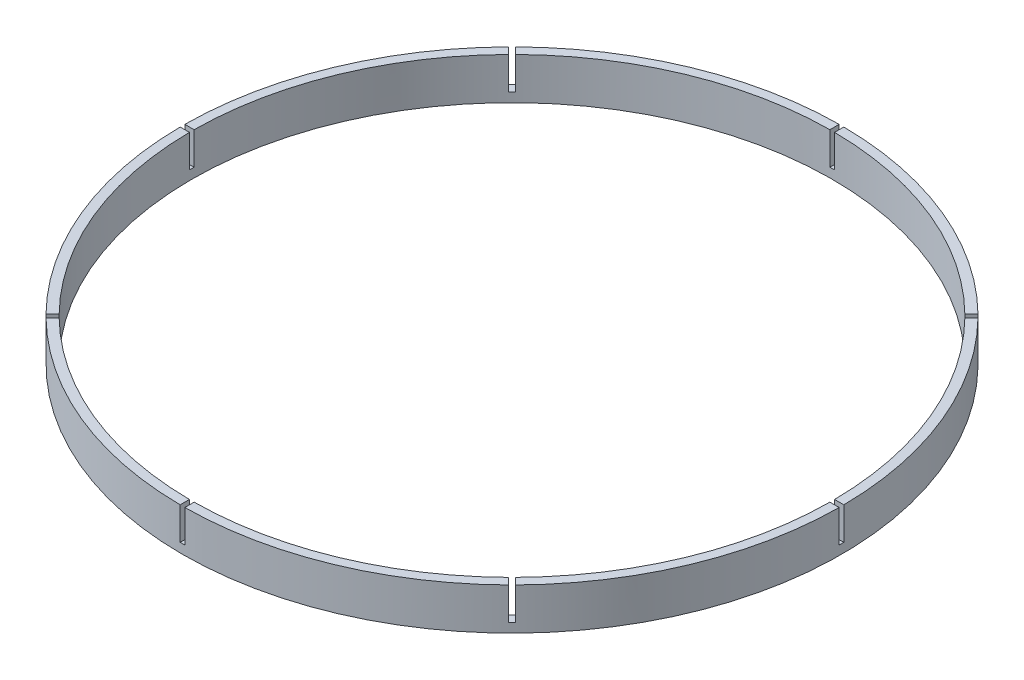
ISO-10303-21;
HEADER;
FILE_DESCRIPTION(('STEP AP214'),'2;1');
FILE_NAME('part.step','',(''),(''),'','','');
FILE_SCHEMA(('AUTOMOTIVE_DESIGN { 1 0 10303 214 1 1 1 1 }'));
ENDSEC;
DATA;
#1=APPLICATION_CONTEXT('core data for automotive mechanical design processes');
#2=APPLICATION_PROTOCOL_DEFINITION('international standard','automotive_design',2000,#1);
#3=PRODUCT_CONTEXT('',#1,'mechanical');
#4=PRODUCT('Part','Part','',(#3));
#5=PRODUCT_RELATED_PRODUCT_CATEGORY('part','',(#4));
#6=PRODUCT_DEFINITION_FORMATION('','',#4);
#7=PRODUCT_DEFINITION_CONTEXT('part definition',#1,'design');
#8=PRODUCT_DEFINITION('design','',#6,#7);
#9=PRODUCT_DEFINITION_SHAPE('','',#8);
#10=(LENGTH_UNIT() NAMED_UNIT(*) SI_UNIT(.MILLI.,.METRE.));
#11=(NAMED_UNIT(*) PLANE_ANGLE_UNIT() SI_UNIT($,.RADIAN.));
#12=(NAMED_UNIT(*) SI_UNIT($,.STERADIAN.) SOLID_ANGLE_UNIT());
#13=UNCERTAINTY_MEASURE_WITH_UNIT(LENGTH_MEASURE(1.E-05),#10,'distance_accuracy_value','');
#14=(GEOMETRIC_REPRESENTATION_CONTEXT(3) GLOBAL_UNCERTAINTY_ASSIGNED_CONTEXT((#13)) GLOBAL_UNIT_ASSIGNED_CONTEXT((#10,
#11,#12)) REPRESENTATION_CONTEXT('',''));
#15=CARTESIAN_POINT('',(0.,0.,0.));
#16=DIRECTION('',(0.,0.,1.));
#17=DIRECTION('',(1.,0.,0.));
#18=AXIS2_PLACEMENT_3D('',#15,#16,#17);
#19=CARTESIAN_POINT('',(0.,9.,0.));
#20=DIRECTION('',(0.,1.,0.));
#21=DIRECTION('',(0.,0.,1.));
#22=AXIS2_PLACEMENT_3D('',#19,#20,#21);
#23=PLANE('',#22);
#24=DIRECTION('',(1.,0.,0.));
#25=VECTOR('',#24,1.);
#26=CARTESIAN_POINT('',(-68.9981883820148,9.,0.500000000000241));
#27=LINE('',#26,#25);
#28=CARTESIAN_POINT('',(-70.9982394147911,9.,0.500000000000242));
#29=VERTEX_POINT('',#28);
#30=CARTESIAN_POINT('',(-68.9981883820148,9.,0.500000000000241));
#31=VERTEX_POINT('',#30);
#32=EDGE_CURVE('E500',#29,#31,#27,.T.);
#33=ORIENTED_EDGE('',*,*,#32,.F.);
#34=CARTESIAN_POINT('',(0.,9.,0.));
#35=DIRECTION('',(0.,1.,0.));
#36=DIRECTION('',(0.,0.,1.));
#37=AXIS2_PLACEMENT_3D('',#34,#35,#36);
#38=CIRCLE('',#37,71.);
#39=CARTESIAN_POINT('',(-50.5568899330978,9.,49.8497831519118));
#40=VERTEX_POINT('',#39);
#41=EDGE_CURVE('E653',#29,#40,#38,.T.);
#42=ORIENTED_EDGE('',*,*,#41,.T.);
#43=DIRECTION('',(-0.707106781186544,0.,0.707106781186551));
#44=VECTOR('',#43,1.);
#45=CARTESIAN_POINT('',(-49.1426402851025,9.,48.4355335039165));
#46=LINE('',#45,#44);
#47=CARTESIAN_POINT('',(-49.1426402851025,9.,48.4355335039165));
#48=VERTEX_POINT('',#47);
#49=EDGE_CURVE('E521',#48,#40,#46,.T.);
#50=ORIENTED_EDGE('',*,*,#49,.F.);
#51=CARTESIAN_POINT('',(0.,9.,0.));
#52=DIRECTION('',(0.,1.,0.));
#53=DIRECTION('',(0.,0.,1.));
#54=AXIS2_PLACEMENT_3D('',#51,#52,#53);
#55=CIRCLE('',#54,69.);
#56=EDGE_CURVE('E622',#31,#48,#55,.T.);
#57=ORIENTED_EDGE('',*,*,#56,.F.);
#58=EDGE_LOOP('',(#33,#42,#50,#57));
#59=FACE_BOUND('',#58,.T.);
#60=ADVANCED_FACE('F35',(#59),#23,.T.);
#61=DIRECTION('',(0.707106781186544,0.,-0.707106781186551));
#62=VECTOR('',#61,1.);
#63=CARTESIAN_POINT('',(-48.435533503916,9.,49.142640285103));
#64=LINE('',#63,#62);
#65=CARTESIAN_POINT('',(-49.8497831519113,9.,50.5568899330984));
#66=VERTEX_POINT('',#65);
#67=CARTESIAN_POINT('',(-48.435533503916,9.,49.142640285103));
#68=VERTEX_POINT('',#67);
#69=EDGE_CURVE('E523',#66,#68,#64,.T.);
#70=ORIENTED_EDGE('',*,*,#69,.F.);
#71=CARTESIAN_POINT('',(-0.5,9.,70.9982394147911));
#72=VERTEX_POINT('',#71);
#73=EDGE_CURVE('E633',#66,#72,#38,.T.);
#74=ORIENTED_EDGE('',*,*,#73,.T.);
#75=DIRECTION('',(0.,0.,1.));
#76=VECTOR('',#75,1.);
#77=CARTESIAN_POINT('',(-0.5,9.,68.9981883820148));
#78=LINE('',#77,#76);
#79=CARTESIAN_POINT('',(-0.5,9.,68.9981883820148));
#80=VERTEX_POINT('',#79);
#81=EDGE_CURVE('E544',#80,#72,#78,.T.);
#82=ORIENTED_EDGE('',*,*,#81,.F.);
#83=EDGE_CURVE('E278',#68,#80,#55,.T.);
#84=ORIENTED_EDGE('',*,*,#83,.F.);
#85=EDGE_LOOP('',(#70,#74,#82,#84));
#86=FACE_BOUND('',#85,.T.);
#87=ADVANCED_FACE('F346',(#86),#23,.T.);
#88=DIRECTION('',(0.,0.,-1.));
#89=VECTOR('',#88,1.);
#90=CARTESIAN_POINT('',(0.5,9.,68.9981883820148));
#91=LINE('',#90,#89);
#92=CARTESIAN_POINT('',(0.499999999999994,9.,70.9982394147911));
#93=VERTEX_POINT('',#92);
#94=CARTESIAN_POINT('',(0.5,9.,68.9981883820148));
#95=VERTEX_POINT('',#94);
#96=EDGE_CURVE('E546',#93,#95,#91,.T.);
#97=ORIENTED_EDGE('',*,*,#96,.F.);
#98=CARTESIAN_POINT('',(49.849783151912,9.,50.5568899330977));
#99=VERTEX_POINT('',#98);
#100=EDGE_CURVE('E647',#93,#99,#38,.T.);
#101=ORIENTED_EDGE('',*,*,#100,.T.);
#102=DIRECTION('',(0.707106781186554,0.,0.707106781186541));
#103=VECTOR('',#102,1.);
#104=CARTESIAN_POINT('',(48.4355335039167,9.,49.1426402851024));
#105=LINE('',#104,#103);
#106=CARTESIAN_POINT('',(48.4355335039167,9.,49.1426402851024));
#107=VERTEX_POINT('',#106);
#108=EDGE_CURVE('E455',#107,#99,#105,.T.);
#109=ORIENTED_EDGE('',*,*,#108,.F.);
#110=EDGE_CURVE('E274',#95,#107,#55,.T.);
#111=ORIENTED_EDGE('',*,*,#110,.F.);
#112=EDGE_LOOP('',(#97,#101,#109,#111));
#113=FACE_BOUND('',#112,.T.);
#114=ADVANCED_FACE('F351',(#113),#23,.T.);
#115=DIRECTION('',(-0.707106781186554,0.,-0.707106781186541));
#116=VECTOR('',#115,1.);
#117=CARTESIAN_POINT('',(49.1426402851032,9.,48.4355335039158));
#118=LINE('',#117,#116);
#119=CARTESIAN_POINT('',(50.5568899330985,9.,49.8497831519111));
#120=VERTEX_POINT('',#119);
#121=CARTESIAN_POINT('',(49.1426402851032,9.,48.4355335039158));
#122=VERTEX_POINT('',#121);
#123=EDGE_CURVE('E567',#120,#122,#118,.T.);
#124=ORIENTED_EDGE('',*,*,#123,.F.);
#125=CARTESIAN_POINT('',(70.9982394147911,9.,0.499999999999256));
#126=VERTEX_POINT('',#125);
#127=EDGE_CURVE('E266',#120,#126,#38,.T.);
#128=ORIENTED_EDGE('',*,*,#127,.T.);
#129=DIRECTION('',(1.,0.,0.));
#130=VECTOR('',#129,1.);
#131=CARTESIAN_POINT('',(68.9981883820148,9.,0.499999999999277));
#132=LINE('',#131,#130);
#133=CARTESIAN_POINT('',(68.9981883820148,9.,0.499999999999277));
#134=VERTEX_POINT('',#133);
#135=EDGE_CURVE('E248',#134,#126,#132,.T.);
#136=ORIENTED_EDGE('',*,*,#135,.F.);
#137=EDGE_CURVE('E264',#122,#134,#55,.T.);
#138=ORIENTED_EDGE('',*,*,#137,.F.);
#139=EDGE_LOOP('',(#124,#128,#136,#138));
#140=FACE_BOUND('',#139,.T.);
#141=ADVANCED_FACE('F263',(#140),#23,.T.);
#142=DIRECTION('',(-1.,0.,0.));
#143=VECTOR('',#142,1.);
#144=CARTESIAN_POINT('',(68.9981883820148,9.,-0.500000000000723));
#145=LINE('',#144,#143);
#146=CARTESIAN_POINT('',(70.9982394147911,9.,-0.500000000000738));
#147=VERTEX_POINT('',#146);
#148=CARTESIAN_POINT('',(68.9981883820148,9.,-0.500000000000723));
#149=VERTEX_POINT('',#148);
#150=EDGE_CURVE('E257',#147,#149,#145,.T.);
#151=ORIENTED_EDGE('',*,*,#150,.F.);
#152=CARTESIAN_POINT('',(50.5568899330975,9.,-49.8497831519122));
#153=VERTEX_POINT('',#152);
#154=EDGE_CURVE('E329',#147,#153,#38,.T.);
#155=ORIENTED_EDGE('',*,*,#154,.T.);
#156=DIRECTION('',(0.707106781186539,0.,-0.707106781186556));
#157=VECTOR('',#156,1.);
#158=CARTESIAN_POINT('',(49.1426402851022,9.,-48.4355335039168));
#159=LINE('',#158,#157);
#160=CARTESIAN_POINT('',(49.1426402851022,9.,-48.4355335039168));
#161=VERTEX_POINT('',#160);
#162=EDGE_CURVE('E476',#161,#153,#159,.T.);
#163=ORIENTED_EDGE('',*,*,#162,.F.);
#164=EDGE_CURVE('E275',#149,#161,#55,.T.);
#165=ORIENTED_EDGE('',*,*,#164,.F.);
#166=EDGE_LOOP('',(#151,#155,#163,#165));
#167=FACE_BOUND('',#166,.T.);
#168=ADVANCED_FACE('F668',(#167),#23,.T.);
#169=DIRECTION('',(-0.707106781186539,0.,0.707106781186556));
#170=VECTOR('',#169,1.);
#171=CARTESIAN_POINT('',(48.4355335039156,9.,-49.1426402851034));
#172=LINE('',#171,#170);
#173=CARTESIAN_POINT('',(49.849783151911,9.,-50.5568899330987));
#174=VERTEX_POINT('',#173);
#175=CARTESIAN_POINT('',(48.4355335039156,9.,-49.1426402851034));
#176=VERTEX_POINT('',#175);
#177=EDGE_CURVE('E326',#174,#176,#172,.T.);
#178=ORIENTED_EDGE('',*,*,#177,.F.);
#179=CARTESIAN_POINT('',(0.5,9.,-70.9982394147911));
#180=VERTEX_POINT('',#179);
#181=EDGE_CURVE('E45',#174,#180,#38,.T.);
#182=ORIENTED_EDGE('',*,*,#181,.T.);
#183=DIRECTION('',(0.,0.,-1.));
#184=VECTOR('',#183,1.);
#185=CARTESIAN_POINT('',(0.5,9.,-68.9981883820148));
#186=LINE('',#185,#184);
#187=CARTESIAN_POINT('',(0.5,9.,-68.9981883820148));
#188=VERTEX_POINT('',#187);
#189=EDGE_CURVE('E306',#188,#180,#186,.T.);
#190=ORIENTED_EDGE('',*,*,#189,.F.);
#191=EDGE_CURVE('E280',#176,#188,#55,.T.);
#192=ORIENTED_EDGE('',*,*,#191,.F.);
#193=EDGE_LOOP('',(#178,#182,#190,#192));
#194=FACE_BOUND('',#193,.T.);
#195=ADVANCED_FACE('F324',(#194),#23,.T.);
#196=DIRECTION('',(-1.,0.,0.));
#197=VECTOR('',#196,1.);
#198=CARTESIAN_POINT('',(-68.9981883820148,9.,-0.499999999999759));
#199=LINE('',#198,#197);
#200=CARTESIAN_POINT('',(-68.9981883820148,9.,-0.499999999999759));
#201=VERTEX_POINT('',#200);
#202=CARTESIAN_POINT('',(-70.9982394147911,9.,-0.499999999999752));
#203=VERTEX_POINT('',#202);
#204=EDGE_CURVE('E498',#201,#203,#199,.T.);
#205=ORIENTED_EDGE('',*,*,#204,.F.);
#206=CARTESIAN_POINT('',(-49.1426402851029,9.,-48.4355335039161));
#207=VERTEX_POINT('',#206);
#208=EDGE_CURVE('E285',#207,#201,#55,.T.);
#209=ORIENTED_EDGE('',*,*,#208,.F.);
#210=DIRECTION('',(0.707106781186549,0.,0.707106781186546));
#211=VECTOR('',#210,1.);
#212=CARTESIAN_POINT('',(-49.1426402851029,9.,-48.4355335039161));
#213=LINE('',#212,#211);
#214=CARTESIAN_POINT('',(-50.5568899330982,9.,-49.8497831519115));
#215=VERTEX_POINT('',#214);
#216=EDGE_CURVE('E588',#215,#207,#213,.T.);
#217=ORIENTED_EDGE('',*,*,#216,.F.);
#218=EDGE_CURVE('E44',#215,#203,#38,.T.);
#219=ORIENTED_EDGE('',*,*,#218,.T.);
#220=EDGE_LOOP('',(#205,#209,#217,#219));
#221=FACE_BOUND('',#220,.T.);
#222=ADVANCED_FACE('F342',(#221),#23,.T.);
#223=DIRECTION('',(-0.707106781186549,0.,-0.707106781186546));
#224=VECTOR('',#223,1.);
#225=CARTESIAN_POINT('',(-48.4355335039163,9.,-49.1426402851027));
#226=LINE('',#225,#224);
#227=CARTESIAN_POINT('',(-48.4355335039163,9.,-49.1426402851027));
#228=VERTEX_POINT('',#227);
#229=CARTESIAN_POINT('',(-49.8497831519117,9.,-50.556889933098));
#230=VERTEX_POINT('',#229);
#231=EDGE_CURVE('E512',#228,#230,#226,.T.);
#232=ORIENTED_EDGE('',*,*,#231,.F.);
#233=CARTESIAN_POINT('',(-0.5,9.,-68.9981883820148));
#234=VERTEX_POINT('',#233);
#235=EDGE_CURVE('E281',#234,#228,#55,.T.);
#236=ORIENTED_EDGE('',*,*,#235,.F.);
#237=DIRECTION('',(0.,0.,1.));
#238=VECTOR('',#237,1.);
#239=CARTESIAN_POINT('',(-0.5,9.,-68.9981883820148));
#240=LINE('',#239,#238);
#241=CARTESIAN_POINT('',(-0.499999999999994,9.,-70.9982394147911));
#242=VERTEX_POINT('',#241);
#243=EDGE_CURVE('E309',#242,#234,#240,.T.);
#244=ORIENTED_EDGE('',*,*,#243,.F.);
#245=EDGE_CURVE('E12',#242,#230,#38,.T.);
#246=ORIENTED_EDGE('',*,*,#245,.T.);
#247=EDGE_LOOP('',(#232,#236,#244,#246));
#248=FACE_BOUND('',#247,.T.);
#249=ADVANCED_FACE('F337',(#248),#23,.T.);
#250=CARTESIAN_POINT('',(0.,0.,0.));
#251=DIRECTION('',(0.,1.,0.));
#252=DIRECTION('',(0.,0.,1.));
#253=AXIS2_PLACEMENT_3D('',#250,#251,#252);
#254=PLANE('',#253);
#255=CARTESIAN_POINT('',(0.,0.,0.));
#256=DIRECTION('',(0.,1.,0.));
#257=DIRECTION('',(0.,0.,1.));
#258=AXIS2_PLACEMENT_3D('',#255,#256,#257);
#259=CIRCLE('',#258,71.);
#260=CARTESIAN_POINT('',(0.,0.,71.));
#261=VERTEX_POINT('',#260);
#262=EDGE_CURVE('E39',#261,#261,#259,.T.);
#263=ORIENTED_EDGE('',*,*,#262,.F.);
#264=EDGE_LOOP('',(#263));
#265=FACE_BOUND('',#264,.T.);
#266=CARTESIAN_POINT('',(0.,0.,0.));
#267=DIRECTION('',(0.,1.,0.));
#268=DIRECTION('',(0.,0.,1.));
#269=AXIS2_PLACEMENT_3D('',#266,#267,#268);
#270=CIRCLE('',#269,69.);
#271=CARTESIAN_POINT('',(0.,0.,69.));
#272=VERTEX_POINT('',#271);
#273=EDGE_CURVE('E288',#272,#272,#270,.T.);
#274=ORIENTED_EDGE('',*,*,#273,.T.);
#275=EDGE_LOOP('',(#274));
#276=FACE_BOUND('',#275,.T.);
#277=ADVANCED_FACE('F335',(#265,#276),#254,.F.);
#278=CARTESIAN_POINT('',(0.,9.,0.));
#279=DIRECTION('',(0.,-1.,0.));
#280=DIRECTION('',(0.,0.,-1.));
#281=AXIS2_PLACEMENT_3D('',#278,#279,#280);
#282=CYLINDRICAL_SURFACE('',#281,71.);
#283=ORIENTED_EDGE('',*,*,#41,.F.);
#284=DIRECTION('',(0.,1.,0.));
#285=VECTOR('',#284,1.);
#286=CARTESIAN_POINT('',(-70.9982394147911,-2.23768848455292,0.500000000000242));
#287=LINE('',#286,#285);
#288=CARTESIAN_POINT('',(-70.9982394147911,2.,0.500000000000242));
#289=VERTEX_POINT('',#288);
#290=EDGE_CURVE('E505',#289,#29,#287,.T.);
#291=ORIENTED_EDGE('',*,*,#290,.F.);
#292=CARTESIAN_POINT('',(0.,2.,0.));
#293=DIRECTION('',(0.,1.,0.));
#294=DIRECTION('',(0.,0.,1.));
#295=AXIS2_PLACEMENT_3D('',#292,#293,#294);
#296=CIRCLE('',#295,71.);
#297=CARTESIAN_POINT('',(-70.9982394147911,2.,-0.499999999999752));
#298=VERTEX_POINT('',#297);
#299=EDGE_CURVE('E489',#289,#298,#296,.F.);
#300=ORIENTED_EDGE('',*,*,#299,.T.);
#301=DIRECTION('',(0.,1.,0.));
#302=VECTOR('',#301,1.);
#303=CARTESIAN_POINT('',(-70.9982394147911,-2.23768848455292,-0.499999999999752));
#304=LINE('',#303,#302);
#305=EDGE_CURVE('E507',#298,#203,#304,.T.);
#306=ORIENTED_EDGE('',*,*,#305,.T.);
#307=ORIENTED_EDGE('',*,*,#218,.F.);
#308=DIRECTION('',(0.,1.,0.));
#309=VECTOR('',#308,1.);
#310=CARTESIAN_POINT('',(-50.5568899330982,-3.00005103277637,-49.8497831519115));
#311=LINE('',#310,#309);
#312=CARTESIAN_POINT('',(-50.5568899330982,2.,-49.8497831519115));
#313=VERTEX_POINT('',#312);
#314=EDGE_CURVE('E593',#313,#215,#311,.T.);
#315=ORIENTED_EDGE('',*,*,#314,.F.);
#316=CARTESIAN_POINT('',(0.,2.,0.));
#317=DIRECTION('',(0.,1.,0.));
#318=DIRECTION('',(0.,0.,1.));
#319=AXIS2_PLACEMENT_3D('',#316,#317,#318);
#320=CIRCLE('',#319,71.);
#321=CARTESIAN_POINT('',(-49.8497831519117,2.,-50.556889933098));
#322=VERTEX_POINT('',#321);
#323=EDGE_CURVE('E578',#313,#322,#320,.F.);
#324=ORIENTED_EDGE('',*,*,#323,.T.);
#325=DIRECTION('',(0.,1.,0.));
#326=VECTOR('',#325,1.);
#327=CARTESIAN_POINT('',(-49.8497831519117,-3.00005103277637,-50.556889933098));
#328=LINE('',#327,#326);
#329=EDGE_CURVE('E595',#322,#230,#328,.T.);
#330=ORIENTED_EDGE('',*,*,#329,.T.);
#331=ORIENTED_EDGE('',*,*,#245,.F.);
#332=DIRECTION('',(0.,1.,0.));
#333=VECTOR('',#332,1.);
#334=CARTESIAN_POINT('',(-0.499999999999994,-2.23768848455292,-70.9982394147911));
#335=LINE('',#334,#333);
#336=CARTESIAN_POINT('',(-0.499999999999994,2.,-70.9982394147911));
#337=VERTEX_POINT('',#336);
#338=EDGE_CURVE('E315',#337,#242,#335,.T.);
#339=ORIENTED_EDGE('',*,*,#338,.F.);
#340=CARTESIAN_POINT('',(0.,2.,0.));
#341=DIRECTION('',(0.,1.,0.));
#342=DIRECTION('',(0.,0.,1.));
#343=AXIS2_PLACEMENT_3D('',#340,#341,#342);
#344=CIRCLE('',#343,71.);
#345=CARTESIAN_POINT('',(0.5,2.,-70.9982394147911));
#346=VERTEX_POINT('',#345);
#347=EDGE_CURVE('E302',#337,#346,#344,.F.);
#348=ORIENTED_EDGE('',*,*,#347,.T.);
#349=DIRECTION('',(0.,1.,0.));
#350=VECTOR('',#349,1.);
#351=CARTESIAN_POINT('',(0.5,-2.23768848455292,-70.9982394147911));
#352=LINE('',#351,#350);
#353=EDGE_CURVE('E317',#346,#180,#352,.T.);
#354=ORIENTED_EDGE('',*,*,#353,.T.);
#355=ORIENTED_EDGE('',*,*,#181,.F.);
#356=DIRECTION('',(0.,1.,0.));
#357=VECTOR('',#356,1.);
#358=CARTESIAN_POINT('',(49.849783151911,-3.00005103277639,-50.5568899330987));
#359=LINE('',#358,#357);
#360=CARTESIAN_POINT('',(49.849783151911,2.,-50.5568899330987));
#361=VERTEX_POINT('',#360);
#362=EDGE_CURVE('E482',#361,#174,#359,.T.);
#363=ORIENTED_EDGE('',*,*,#362,.F.);
#364=CARTESIAN_POINT('',(0.,2.,0.));
#365=DIRECTION('',(0.,1.,0.));
#366=DIRECTION('',(0.,0.,1.));
#367=AXIS2_PLACEMENT_3D('',#364,#365,#366);
#368=CIRCLE('',#367,71.);
#369=CARTESIAN_POINT('',(50.5568899330975,2.,-49.8497831519122));
#370=VERTEX_POINT('',#369);
#371=EDGE_CURVE('E467',#361,#370,#368,.F.);
#372=ORIENTED_EDGE('',*,*,#371,.T.);
#373=DIRECTION('',(0.,1.,0.));
#374=VECTOR('',#373,1.);
#375=CARTESIAN_POINT('',(50.5568899330975,-3.00005103277639,-49.8497831519122));
#376=LINE('',#375,#374);
#377=EDGE_CURVE('E484',#370,#153,#376,.T.);
#378=ORIENTED_EDGE('',*,*,#377,.T.);
#379=ORIENTED_EDGE('',*,*,#154,.F.);
#380=DIRECTION('',(0.,1.,0.));
#381=VECTOR('',#380,1.);
#382=CARTESIAN_POINT('',(70.9982394147911,-2.23768848455292,-0.500000000000738));
#383=LINE('',#382,#381);
#384=CARTESIAN_POINT('',(70.9982394147911,2.,-0.500000000000737));
#385=VERTEX_POINT('',#384);
#386=EDGE_CURVE('E464',#385,#147,#383,.T.);
#387=ORIENTED_EDGE('',*,*,#386,.F.);
#388=CARTESIAN_POINT('',(0.,2.,0.));
#389=DIRECTION('',(0.,1.,0.));
#390=DIRECTION('',(0.,0.,1.));
#391=AXIS2_PLACEMENT_3D('',#388,#389,#390);
#392=CIRCLE('',#391,71.);
#393=CARTESIAN_POINT('',(70.9982394147911,2.,0.499999999999256));
#394=VERTEX_POINT('',#393);
#395=EDGE_CURVE('E457',#385,#394,#392,.F.);
#396=ORIENTED_EDGE('',*,*,#395,.T.);
#397=DIRECTION('',(0.,1.,0.));
#398=VECTOR('',#397,1.);
#399=CARTESIAN_POINT('',(70.9982394147911,-2.23768848455292,0.499999999999256));
#400=LINE('',#399,#398);
#401=EDGE_CURVE('E256',#394,#126,#400,.T.);
#402=ORIENTED_EDGE('',*,*,#401,.T.);
#403=ORIENTED_EDGE('',*,*,#127,.F.);
#404=DIRECTION('',(0.,1.,0.));
#405=VECTOR('',#404,1.);
#406=CARTESIAN_POINT('',(50.5568899330985,-3.00005103277638,49.8497831519111));
#407=LINE('',#406,#405);
#408=CARTESIAN_POINT('',(50.5568899330985,2.,49.8497831519111));
#409=VERTEX_POINT('',#408);
#410=EDGE_CURVE('E571',#409,#120,#407,.T.);
#411=ORIENTED_EDGE('',*,*,#410,.F.);
#412=CARTESIAN_POINT('',(0.,2.,0.));
#413=DIRECTION('',(0.,1.,0.));
#414=DIRECTION('',(0.,0.,1.));
#415=AXIS2_PLACEMENT_3D('',#412,#413,#414);
#416=CIRCLE('',#415,71.);
#417=CARTESIAN_POINT('',(49.849783151912,2.,50.5568899330977));
#418=VERTEX_POINT('',#417);
#419=EDGE_CURVE('E559',#409,#418,#416,.F.);
#420=ORIENTED_EDGE('',*,*,#419,.T.);
#421=DIRECTION('',(0.,1.,0.));
#422=VECTOR('',#421,1.);
#423=CARTESIAN_POINT('',(49.849783151912,-3.00005103277638,50.5568899330977));
#424=LINE('',#423,#422);
#425=EDGE_CURVE('E573',#418,#99,#424,.T.);
#426=ORIENTED_EDGE('',*,*,#425,.T.);
#427=ORIENTED_EDGE('',*,*,#100,.F.);
#428=DIRECTION('',(0.,1.,0.));
#429=VECTOR('',#428,1.);
#430=CARTESIAN_POINT('',(0.499999999999994,-2.23768848455292,70.9982394147911));
#431=LINE('',#430,#429);
#432=CARTESIAN_POINT('',(0.499999999999994,2.,70.9982394147911));
#433=VERTEX_POINT('',#432);
#434=EDGE_CURVE('E552',#433,#93,#431,.T.);
#435=ORIENTED_EDGE('',*,*,#434,.F.);
#436=CARTESIAN_POINT('',(0.,2.,0.));
#437=DIRECTION('',(0.,1.,0.));
#438=DIRECTION('',(0.,0.,1.));
#439=AXIS2_PLACEMENT_3D('',#436,#437,#438);
#440=CIRCLE('',#439,71.);
#441=CARTESIAN_POINT('',(-0.5,2.,70.9982394147911));
#442=VERTEX_POINT('',#441);
#443=EDGE_CURVE('E535',#433,#442,#440,.F.);
#444=ORIENTED_EDGE('',*,*,#443,.T.);
#445=DIRECTION('',(0.,1.,0.));
#446=VECTOR('',#445,1.);
#447=CARTESIAN_POINT('',(-0.5,-2.23768848455292,70.9982394147911));
#448=LINE('',#447,#446);
#449=EDGE_CURVE('E554',#442,#72,#448,.T.);
#450=ORIENTED_EDGE('',*,*,#449,.T.);
#451=ORIENTED_EDGE('',*,*,#73,.F.);
#452=DIRECTION('',(0.,1.,0.));
#453=VECTOR('',#452,1.);
#454=CARTESIAN_POINT('',(-49.8497831519113,-3.00005103277637,50.5568899330984));
#455=LINE('',#454,#453);
#456=CARTESIAN_POINT('',(-49.8497831519113,2.,50.5568899330984));
#457=VERTEX_POINT('',#456);
#458=EDGE_CURVE('E528',#457,#66,#455,.T.);
#459=ORIENTED_EDGE('',*,*,#458,.F.);
#460=CARTESIAN_POINT('',(0.,2.,0.));
#461=DIRECTION('',(0.,1.,0.));
#462=DIRECTION('',(0.,0.,1.));
#463=AXIS2_PLACEMENT_3D('',#460,#461,#462);
#464=CIRCLE('',#463,71.);
#465=CARTESIAN_POINT('',(-50.5568899330978,2.,49.8497831519118));
#466=VERTEX_POINT('',#465);
#467=EDGE_CURVE('E513',#457,#466,#464,.F.);
#468=ORIENTED_EDGE('',*,*,#467,.T.);
#469=DIRECTION('',(0.,1.,0.));
#470=VECTOR('',#469,1.);
#471=CARTESIAN_POINT('',(-50.5568899330978,-3.00005103277637,49.8497831519118));
#472=LINE('',#471,#470);
#473=EDGE_CURVE('E530',#466,#40,#472,.T.);
#474=ORIENTED_EDGE('',*,*,#473,.T.);
#475=EDGE_LOOP('',(#283,#291,#300,#306,#307,#315,#324,#330,#331,#339,#348,#354,#355,#363,#372,
#378,#379,#387,#396,#402,#403,#411,#420,#426,#427,#435,#444,#450,#451,#459,#468,#474));
#476=FACE_BOUND('',#475,.T.);
#477=ORIENTED_EDGE('',*,*,#262,.T.);
#478=EDGE_LOOP('',(#477));
#479=FACE_BOUND('',#478,.T.);
#480=ADVANCED_FACE('F37',(#476,#479),#282,.T.);
#481=CARTESIAN_POINT('',(0.,9.,0.));
#482=DIRECTION('',(0.,-1.,0.));
#483=DIRECTION('',(0.,0.,-1.));
#484=AXIS2_PLACEMENT_3D('',#481,#482,#483);
#485=CYLINDRICAL_SURFACE('',#484,69.);
#486=DIRECTION('',(0.,1.,0.));
#487=VECTOR('',#486,1.);
#488=CARTESIAN_POINT('',(-68.9981883820148,-2.23768848455292,0.500000000000241));
#489=LINE('',#488,#487);
#490=CARTESIAN_POINT('',(-68.9981883820148,2.,0.500000000000241));
#491=VERTEX_POINT('',#490);
#492=EDGE_CURVE('E52',#491,#31,#489,.T.);
#493=ORIENTED_EDGE('',*,*,#492,.T.);
#494=ORIENTED_EDGE('',*,*,#56,.T.);
#495=DIRECTION('',(0.,1.,0.));
#496=VECTOR('',#495,1.);
#497=CARTESIAN_POINT('',(-49.1426402851025,-3.00005103277637,48.4355335039165));
#498=LINE('',#497,#496);
#499=CARTESIAN_POINT('',(-49.1426402851025,2.,48.4355335039165));
#500=VERTEX_POINT('',#499);
#501=EDGE_CURVE('E526',#500,#48,#498,.T.);
#502=ORIENTED_EDGE('',*,*,#501,.F.);
#503=CARTESIAN_POINT('',(0.,2.,0.));
#504=DIRECTION('',(0.,1.,0.));
#505=DIRECTION('',(0.,0.,1.));
#506=AXIS2_PLACEMENT_3D('',#503,#504,#505);
#507=CIRCLE('',#506,69.);
#508=CARTESIAN_POINT('',(-48.435533503916,2.,49.142640285103));
#509=VERTEX_POINT('',#508);
#510=EDGE_CURVE('E518',#500,#509,#507,.T.);
#511=ORIENTED_EDGE('',*,*,#510,.T.);
#512=DIRECTION('',(0.,1.,0.));
#513=VECTOR('',#512,1.);
#514=CARTESIAN_POINT('',(-48.435533503916,-3.00005103277637,49.142640285103));
#515=LINE('',#514,#513);
#516=EDGE_CURVE('E60',#509,#68,#515,.T.);
#517=ORIENTED_EDGE('',*,*,#516,.T.);
#518=ORIENTED_EDGE('',*,*,#83,.T.);
#519=DIRECTION('',(0.,1.,0.));
#520=VECTOR('',#519,1.);
#521=CARTESIAN_POINT('',(-0.5,-2.23768848455292,68.9981883820148));
#522=LINE('',#521,#520);
#523=CARTESIAN_POINT('',(-0.5,2.,68.9981883820148));
#524=VERTEX_POINT('',#523);
#525=EDGE_CURVE('E549',#524,#80,#522,.T.);
#526=ORIENTED_EDGE('',*,*,#525,.F.);
#527=CARTESIAN_POINT('',(0.,2.,0.));
#528=DIRECTION('',(0.,1.,0.));
#529=DIRECTION('',(0.,0.,1.));
#530=AXIS2_PLACEMENT_3D('',#527,#528,#529);
#531=CIRCLE('',#530,69.);
#532=CARTESIAN_POINT('',(0.5,2.,68.9981883820148));
#533=VERTEX_POINT('',#532);
#534=EDGE_CURVE('E541',#524,#533,#531,.T.);
#535=ORIENTED_EDGE('',*,*,#534,.T.);
#536=DIRECTION('',(0.,1.,0.));
#537=VECTOR('',#536,1.);
#538=CARTESIAN_POINT('',(0.5,-2.23768848455292,68.9981883820148));
#539=LINE('',#538,#537);
#540=EDGE_CURVE('E539',#533,#95,#539,.T.);
#541=ORIENTED_EDGE('',*,*,#540,.T.);
#542=ORIENTED_EDGE('',*,*,#110,.T.);
#543=DIRECTION('',(0.,1.,0.));
#544=VECTOR('',#543,1.);
#545=CARTESIAN_POINT('',(48.4355335039167,-3.00005103277638,49.1426402851024));
#546=LINE('',#545,#544);
#547=CARTESIAN_POINT('',(48.4355335039167,2.,49.1426402851024));
#548=VERTEX_POINT('',#547);
#549=EDGE_CURVE('E569',#548,#107,#546,.T.);
#550=ORIENTED_EDGE('',*,*,#549,.F.);
#551=CARTESIAN_POINT('',(0.,2.,0.));
#552=DIRECTION('',(0.,1.,0.));
#553=DIRECTION('',(0.,0.,1.));
#554=AXIS2_PLACEMENT_3D('',#551,#552,#553);
#555=CIRCLE('',#554,69.);
#556=CARTESIAN_POINT('',(49.1426402851032,2.,48.4355335039158));
#557=VERTEX_POINT('',#556);
#558=EDGE_CURVE('E564',#548,#557,#555,.T.);
#559=ORIENTED_EDGE('',*,*,#558,.T.);
#560=DIRECTION('',(0.,1.,0.));
#561=VECTOR('',#560,1.);
#562=CARTESIAN_POINT('',(49.1426402851032,-3.00005103277638,48.4355335039158));
#563=LINE('',#562,#561);
#564=EDGE_CURVE('E273',#557,#122,#563,.T.);
#565=ORIENTED_EDGE('',*,*,#564,.T.);
#566=ORIENTED_EDGE('',*,*,#137,.T.);
#567=DIRECTION('',(0.,1.,0.));
#568=VECTOR('',#567,1.);
#569=CARTESIAN_POINT('',(68.9981883820148,-2.23768848455292,0.499999999999277));
#570=LINE('',#569,#568);
#571=CARTESIAN_POINT('',(68.9981883820148,2.,0.499999999999277));
#572=VERTEX_POINT('',#571);
#573=EDGE_CURVE('E245',#572,#134,#570,.T.);
#574=ORIENTED_EDGE('',*,*,#573,.F.);
#575=CARTESIAN_POINT('',(0.,2.,0.));
#576=DIRECTION('',(0.,1.,0.));
#577=DIRECTION('',(0.,0.,1.));
#578=AXIS2_PLACEMENT_3D('',#575,#576,#577);
#579=CIRCLE('',#578,69.);
#580=CARTESIAN_POINT('',(68.9981883820148,2.,-0.500000000000723));
#581=VERTEX_POINT('',#580);
#582=EDGE_CURVE('E449',#572,#581,#579,.T.);
#583=ORIENTED_EDGE('',*,*,#582,.T.);
#584=DIRECTION('',(0.,1.,0.));
#585=VECTOR('',#584,1.);
#586=CARTESIAN_POINT('',(68.9981883820148,-2.23768848455292,-0.500000000000723));
#587=LINE('',#586,#585);
#588=EDGE_CURVE('E462',#581,#149,#587,.T.);
#589=ORIENTED_EDGE('',*,*,#588,.T.);
#590=ORIENTED_EDGE('',*,*,#164,.T.);
#591=DIRECTION('',(0.,1.,0.));
#592=VECTOR('',#591,1.);
#593=CARTESIAN_POINT('',(49.1426402851022,-3.00005103277639,-48.4355335039168));
#594=LINE('',#593,#592);
#595=CARTESIAN_POINT('',(49.1426402851022,2.,-48.4355335039168));
#596=VERTEX_POINT('',#595);
#597=EDGE_CURVE('E479',#596,#161,#594,.T.);
#598=ORIENTED_EDGE('',*,*,#597,.F.);
#599=CARTESIAN_POINT('',(0.,2.,0.));
#600=DIRECTION('',(0.,1.,0.));
#601=DIRECTION('',(0.,0.,1.));
#602=AXIS2_PLACEMENT_3D('',#599,#600,#601);
#603=CIRCLE('',#602,69.);
#604=CARTESIAN_POINT('',(48.4355335039156,2.,-49.1426402851034));
#605=VERTEX_POINT('',#604);
#606=EDGE_CURVE('E473',#596,#605,#603,.T.);
#607=ORIENTED_EDGE('',*,*,#606,.T.);
#608=DIRECTION('',(0.,1.,0.));
#609=VECTOR('',#608,1.);
#610=CARTESIAN_POINT('',(48.4355335039156,-3.00005103277639,-49.1426402851034));
#611=LINE('',#610,#609);
#612=EDGE_CURVE('E471',#605,#176,#611,.T.);
#613=ORIENTED_EDGE('',*,*,#612,.T.);
#614=ORIENTED_EDGE('',*,*,#191,.T.);
#615=DIRECTION('',(0.,1.,0.));
#616=VECTOR('',#615,1.);
#617=CARTESIAN_POINT('',(0.5,-2.23768848455292,-68.9981883820148));
#618=LINE('',#617,#616);
#619=CARTESIAN_POINT('',(0.5,2.,-68.9981883820148));
#620=VERTEX_POINT('',#619);
#621=EDGE_CURVE('E312',#620,#188,#618,.T.);
#622=ORIENTED_EDGE('',*,*,#621,.F.);
#623=CARTESIAN_POINT('',(0.,2.,0.));
#624=DIRECTION('',(0.,1.,0.));
#625=DIRECTION('',(0.,0.,1.));
#626=AXIS2_PLACEMENT_3D('',#623,#624,#625);
#627=CIRCLE('',#626,69.);
#628=CARTESIAN_POINT('',(-0.5,2.,-68.9981883820148));
#629=VERTEX_POINT('',#628);
#630=EDGE_CURVE('E292',#620,#629,#627,.T.);
#631=ORIENTED_EDGE('',*,*,#630,.T.);
#632=DIRECTION('',(0.,1.,0.));
#633=VECTOR('',#632,1.);
#634=CARTESIAN_POINT('',(-0.5,-2.23768848455292,-68.9981883820148));
#635=LINE('',#634,#633);
#636=EDGE_CURVE('E313',#629,#234,#635,.T.);
#637=ORIENTED_EDGE('',*,*,#636,.T.);
#638=ORIENTED_EDGE('',*,*,#235,.T.);
#639=DIRECTION('',(0.,1.,0.));
#640=VECTOR('',#639,1.);
#641=CARTESIAN_POINT('',(-48.4355335039163,-3.00005103277637,-49.1426402851027));
#642=LINE('',#641,#640);
#643=CARTESIAN_POINT('',(-48.4355335039163,2.,-49.1426402851027));
#644=VERTEX_POINT('',#643);
#645=EDGE_CURVE('E590',#644,#228,#642,.T.);
#646=ORIENTED_EDGE('',*,*,#645,.F.);
#647=CARTESIAN_POINT('',(0.,2.,0.));
#648=DIRECTION('',(0.,1.,0.));
#649=DIRECTION('',(0.,0.,1.));
#650=AXIS2_PLACEMENT_3D('',#647,#648,#649);
#651=CIRCLE('',#650,69.);
#652=CARTESIAN_POINT('',(-49.1426402851029,2.,-48.4355335039161));
#653=VERTEX_POINT('',#652);
#654=EDGE_CURVE('E584',#644,#653,#651,.T.);
#655=ORIENTED_EDGE('',*,*,#654,.T.);
#656=DIRECTION('',(0.,1.,0.));
#657=VECTOR('',#656,1.);
#658=CARTESIAN_POINT('',(-49.1426402851029,-3.00005103277637,-48.4355335039161));
#659=LINE('',#658,#657);
#660=EDGE_CURVE('E582',#653,#207,#659,.T.);
#661=ORIENTED_EDGE('',*,*,#660,.T.);
#662=ORIENTED_EDGE('',*,*,#208,.T.);
#663=DIRECTION('',(0.,1.,0.));
#664=VECTOR('',#663,1.);
#665=CARTESIAN_POINT('',(-68.9981883820148,-2.23768848455292,-0.499999999999759));
#666=LINE('',#665,#664);
#667=CARTESIAN_POINT('',(-68.9981883820148,2.,-0.499999999999759));
#668=VERTEX_POINT('',#667);
#669=EDGE_CURVE('E503',#668,#201,#666,.T.);
#670=ORIENTED_EDGE('',*,*,#669,.F.);
#671=CARTESIAN_POINT('',(0.,2.,0.));
#672=DIRECTION('',(0.,1.,0.));
#673=DIRECTION('',(0.,0.,1.));
#674=AXIS2_PLACEMENT_3D('',#671,#672,#673);
#675=CIRCLE('',#674,69.);
#676=EDGE_CURVE('E494',#668,#491,#675,.T.);
#677=ORIENTED_EDGE('',*,*,#676,.T.);
#678=EDGE_LOOP('',(#493,#494,#502,#511,#517,#518,#526,#535,#541,#542,#550,#559,#565,#566,#574,
#583,#589,#590,#598,#607,#613,#614,#622,#631,#637,#638,#646,#655,#661,#662,#670,#677));
#679=FACE_BOUND('',#678,.T.);
#680=ORIENTED_EDGE('',*,*,#273,.F.);
#681=EDGE_LOOP('',(#680));
#682=FACE_BOUND('',#681,.T.);
#683=ADVANCED_FACE('F270',(#679,#682),#485,.F.);
#684=CARTESIAN_POINT('',(-0.5,-2.23768848455292,-68.9981883820148));
#685=DIRECTION('',(-1.,0.,0.));
#686=DIRECTION('',(0.,0.,1.));
#687=AXIS2_PLACEMENT_3D('',#684,#685,#686);
#688=PLANE('',#687);
#689=DIRECTION('',(0.,0.,-1.));
#690=VECTOR('',#689,1.);
#691=CARTESIAN_POINT('',(-0.5,2.,-68.9981883820148));
#692=LINE('',#691,#690);
#693=EDGE_CURVE('E298',#629,#337,#692,.T.);
#694=ORIENTED_EDGE('',*,*,#693,.T.);
#695=ORIENTED_EDGE('',*,*,#338,.T.);
#696=ORIENTED_EDGE('',*,*,#243,.T.);
#697=ORIENTED_EDGE('',*,*,#636,.F.);
#698=EDGE_LOOP('',(#694,#695,#696,#697));
#699=FACE_BOUND('',#698,.T.);
#700=ADVANCED_FACE('F357',(#699),#688,.F.);
#701=CARTESIAN_POINT('',(0.5,-2.23768848455292,-68.9981883820148));
#702=DIRECTION('',(1.,0.,0.));
#703=DIRECTION('',(0.,0.,-1.));
#704=AXIS2_PLACEMENT_3D('',#701,#702,#703);
#705=PLANE('',#704);
#706=DIRECTION('',(0.,0.,1.));
#707=VECTOR('',#706,1.);
#708=CARTESIAN_POINT('',(0.5,2.,-68.9981883820148));
#709=LINE('',#708,#707);
#710=EDGE_CURVE('E286',#346,#620,#709,.T.);
#711=ORIENTED_EDGE('',*,*,#710,.T.);
#712=ORIENTED_EDGE('',*,*,#621,.T.);
#713=ORIENTED_EDGE('',*,*,#189,.T.);
#714=ORIENTED_EDGE('',*,*,#353,.F.);
#715=EDGE_LOOP('',(#711,#712,#713,#714));
#716=FACE_BOUND('',#715,.T.);
#717=ADVANCED_FACE('F320',(#716),#705,.F.);
#718=CARTESIAN_POINT('',(0.,2.,0.));
#719=DIRECTION('',(0.,1.,0.));
#720=DIRECTION('',(0.,0.,1.));
#721=AXIS2_PLACEMENT_3D('',#718,#719,#720);
#722=PLANE('',#721);
#723=ORIENTED_EDGE('',*,*,#630,.F.);
#724=ORIENTED_EDGE('',*,*,#710,.F.);
#725=ORIENTED_EDGE('',*,*,#347,.F.);
#726=ORIENTED_EDGE('',*,*,#693,.F.);
#727=EDGE_LOOP('',(#723,#724,#725,#726));
#728=FACE_BOUND('',#727,.T.);
#729=ADVANCED_FACE('F360',(#728),#722,.T.);
#730=CARTESIAN_POINT('',(-49.1426402851029,-3.00005103277637,-48.4355335039161));
#731=DIRECTION('',(-0.707106781186546,0.,0.707106781186549));
#732=DIRECTION('',(0.707106781186549,0.,0.707106781186546));
#733=AXIS2_PLACEMENT_3D('',#730,#731,#732);
#734=PLANE('',#733);
#735=DIRECTION('',(-0.707106781186549,0.,-0.707106781186546));
#736=VECTOR('',#735,1.);
#737=CARTESIAN_POINT('',(-49.1426402851029,2.,-48.4355335039161));
#738=LINE('',#737,#736);
#739=EDGE_CURVE('E581',#653,#313,#738,.T.);
#740=ORIENTED_EDGE('',*,*,#739,.T.);
#741=ORIENTED_EDGE('',*,*,#314,.T.);
#742=ORIENTED_EDGE('',*,*,#216,.T.);
#743=ORIENTED_EDGE('',*,*,#660,.F.);
#744=EDGE_LOOP('',(#740,#741,#742,#743));
#745=FACE_BOUND('',#744,.T.);
#746=ADVANCED_FACE('F366',(#745),#734,.F.);
#747=CARTESIAN_POINT('',(-48.4355335039163,-3.00005103277637,-49.1426402851027));
#748=DIRECTION('',(0.707106781186546,0.,-0.707106781186549));
#749=DIRECTION('',(-0.707106781186549,0.,-0.707106781186546));
#750=AXIS2_PLACEMENT_3D('',#747,#748,#749);
#751=PLANE('',#750);
#752=DIRECTION('',(0.707106781186549,0.,0.707106781186546));
#753=VECTOR('',#752,1.);
#754=CARTESIAN_POINT('',(-48.4355335039163,2.,-49.1426402851027));
#755=LINE('',#754,#753);
#756=EDGE_CURVE('E310',#322,#644,#755,.T.);
#757=ORIENTED_EDGE('',*,*,#756,.T.);
#758=ORIENTED_EDGE('',*,*,#645,.T.);
#759=ORIENTED_EDGE('',*,*,#231,.T.);
#760=ORIENTED_EDGE('',*,*,#329,.F.);
#761=EDGE_LOOP('',(#757,#758,#759,#760));
#762=FACE_BOUND('',#761,.T.);
#763=ADVANCED_FACE('F368',(#762),#751,.F.);
#764=CARTESIAN_POINT('',(0.,2.,0.));
#765=DIRECTION('',(0.,1.,0.));
#766=DIRECTION('',(0.,0.,1.));
#767=AXIS2_PLACEMENT_3D('',#764,#765,#766);
#768=PLANE('',#767);
#769=ORIENTED_EDGE('',*,*,#654,.F.);
#770=ORIENTED_EDGE('',*,*,#756,.F.);
#771=ORIENTED_EDGE('',*,*,#323,.F.);
#772=ORIENTED_EDGE('',*,*,#739,.F.);
#773=EDGE_LOOP('',(#769,#770,#771,#772));
#774=FACE_BOUND('',#773,.T.);
#775=ADVANCED_FACE('F371',(#774),#768,.T.);
#776=CARTESIAN_POINT('',(48.4355335039156,-3.00005103277639,-49.1426402851034));
#777=DIRECTION('',(-0.707106781186556,0.,-0.707106781186539));
#778=DIRECTION('',(-0.707106781186539,0.,0.707106781186556));
#779=AXIS2_PLACEMENT_3D('',#776,#777,#778);
#780=PLANE('',#779);
#781=DIRECTION('',(0.707106781186539,0.,-0.707106781186556));
#782=VECTOR('',#781,1.);
#783=CARTESIAN_POINT('',(48.4355335039156,2.,-49.1426402851034));
#784=LINE('',#783,#782);
#785=EDGE_CURVE('E470',#605,#361,#784,.T.);
#786=ORIENTED_EDGE('',*,*,#785,.T.);
#787=ORIENTED_EDGE('',*,*,#362,.T.);
#788=ORIENTED_EDGE('',*,*,#177,.T.);
#789=ORIENTED_EDGE('',*,*,#612,.F.);
#790=EDGE_LOOP('',(#786,#787,#788,#789));
#791=FACE_BOUND('',#790,.T.);
#792=ADVANCED_FACE('F378',(#791),#780,.F.);
#793=CARTESIAN_POINT('',(49.1426402851022,-3.00005103277639,-48.4355335039168));
#794=DIRECTION('',(0.707106781186556,0.,0.707106781186539));
#795=DIRECTION('',(0.707106781186539,0.,-0.707106781186556));
#796=AXIS2_PLACEMENT_3D('',#793,#794,#795);
#797=PLANE('',#796);
#798=DIRECTION('',(-0.707106781186539,0.,0.707106781186556));
#799=VECTOR('',#798,1.);
#800=CARTESIAN_POINT('',(49.1426402851022,2.,-48.4355335039168));
#801=LINE('',#800,#799);
#802=EDGE_CURVE('E267',#370,#596,#801,.T.);
#803=ORIENTED_EDGE('',*,*,#802,.T.);
#804=ORIENTED_EDGE('',*,*,#597,.T.);
#805=ORIENTED_EDGE('',*,*,#162,.T.);
#806=ORIENTED_EDGE('',*,*,#377,.F.);
#807=EDGE_LOOP('',(#803,#804,#805,#806));
#808=FACE_BOUND('',#807,.T.);
#809=ADVANCED_FACE('F427',(#808),#797,.F.);
#810=CARTESIAN_POINT('',(0.,2.,0.));
#811=DIRECTION('',(0.,1.,0.));
#812=DIRECTION('',(0.,0.,1.));
#813=AXIS2_PLACEMENT_3D('',#810,#811,#812);
#814=PLANE('',#813);
#815=ORIENTED_EDGE('',*,*,#606,.F.);
#816=ORIENTED_EDGE('',*,*,#802,.F.);
#817=ORIENTED_EDGE('',*,*,#371,.F.);
#818=ORIENTED_EDGE('',*,*,#785,.F.);
#819=EDGE_LOOP('',(#815,#816,#817,#818));
#820=FACE_BOUND('',#819,.T.);
#821=ADVANCED_FACE('F430',(#820),#814,.T.);
#822=CARTESIAN_POINT('',(68.9981883820148,-2.23768848455292,-0.500000000000723));
#823=DIRECTION('',(0.,0.,-1.));
#824=DIRECTION('',(-1.,0.,0.));
#825=AXIS2_PLACEMENT_3D('',#822,#823,#824);
#826=PLANE('',#825);
#827=DIRECTION('',(1.,0.,0.));
#828=VECTOR('',#827,1.);
#829=CARTESIAN_POINT('',(68.9981883820148,2.,-0.500000000000723));
#830=LINE('',#829,#828);
#831=EDGE_CURVE('E452',#581,#385,#830,.T.);
#832=ORIENTED_EDGE('',*,*,#831,.T.);
#833=ORIENTED_EDGE('',*,*,#386,.T.);
#834=ORIENTED_EDGE('',*,*,#150,.T.);
#835=ORIENTED_EDGE('',*,*,#588,.F.);
#836=EDGE_LOOP('',(#832,#833,#834,#835));
#837=FACE_BOUND('',#836,.T.);
#838=ADVANCED_FACE('F437',(#837),#826,.F.);
#839=CARTESIAN_POINT('',(68.9981883820148,-2.23768848455292,0.499999999999277));
#840=DIRECTION('',(0.,0.,1.));
#841=DIRECTION('',(1.,0.,0.));
#842=AXIS2_PLACEMENT_3D('',#839,#840,#841);
#843=PLANE('',#842);
#844=DIRECTION('',(-1.,0.,0.));
#845=VECTOR('',#844,1.);
#846=CARTESIAN_POINT('',(68.9981883820148,2.,0.499999999999277));
#847=LINE('',#846,#845);
#848=EDGE_CURVE('E251',#394,#572,#847,.T.);
#849=ORIENTED_EDGE('',*,*,#848,.T.);
#850=ORIENTED_EDGE('',*,*,#573,.T.);
#851=ORIENTED_EDGE('',*,*,#135,.T.);
#852=ORIENTED_EDGE('',*,*,#401,.F.);
#853=EDGE_LOOP('',(#849,#850,#851,#852));
#854=FACE_BOUND('',#853,.T.);
#855=ADVANCED_FACE('F247',(#854),#843,.F.);
#856=CARTESIAN_POINT('',(0.,2.,0.));
#857=DIRECTION('',(0.,1.,0.));
#858=DIRECTION('',(0.,0.,1.));
#859=AXIS2_PLACEMENT_3D('',#856,#857,#858);
#860=PLANE('',#859);
#861=ORIENTED_EDGE('',*,*,#582,.F.);
#862=ORIENTED_EDGE('',*,*,#848,.F.);
#863=ORIENTED_EDGE('',*,*,#395,.F.);
#864=ORIENTED_EDGE('',*,*,#831,.F.);
#865=EDGE_LOOP('',(#861,#862,#863,#864));
#866=FACE_BOUND('',#865,.T.);
#867=ADVANCED_FACE('F388',(#866),#860,.T.);
#868=CARTESIAN_POINT('',(49.1426402851032,-3.00005103277638,48.4355335039158));
#869=DIRECTION('',(0.707106781186541,0.,-0.707106781186554));
#870=DIRECTION('',(-0.707106781186554,0.,-0.707106781186541));
#871=AXIS2_PLACEMENT_3D('',#868,#869,#870);
#872=PLANE('',#871);
#873=DIRECTION('',(0.707106781186554,0.,0.707106781186541));
#874=VECTOR('',#873,1.);
#875=CARTESIAN_POINT('',(49.1426402851032,2.,48.4355335039158));
#876=LINE('',#875,#874);
#877=EDGE_CURVE('E562',#557,#409,#876,.T.);
#878=ORIENTED_EDGE('',*,*,#877,.T.);
#879=ORIENTED_EDGE('',*,*,#410,.T.);
#880=ORIENTED_EDGE('',*,*,#123,.T.);
#881=ORIENTED_EDGE('',*,*,#564,.F.);
#882=EDGE_LOOP('',(#878,#879,#880,#881));
#883=FACE_BOUND('',#882,.T.);
#884=ADVANCED_FACE('F384',(#883),#872,.F.);
#885=CARTESIAN_POINT('',(48.4355335039167,-3.00005103277638,49.1426402851024));
#886=DIRECTION('',(-0.707106781186541,0.,0.707106781186554));
#887=DIRECTION('',(0.707106781186554,0.,0.707106781186541));
#888=AXIS2_PLACEMENT_3D('',#885,#886,#887);
#889=PLANE('',#888);
#890=DIRECTION('',(-0.707106781186554,0.,-0.707106781186541));
#891=VECTOR('',#890,1.);
#892=CARTESIAN_POINT('',(48.4355335039167,2.,49.1426402851024));
#893=LINE('',#892,#891);
#894=EDGE_CURVE('E547',#418,#548,#893,.T.);
#895=ORIENTED_EDGE('',*,*,#894,.T.);
#896=ORIENTED_EDGE('',*,*,#549,.T.);
#897=ORIENTED_EDGE('',*,*,#108,.T.);
#898=ORIENTED_EDGE('',*,*,#425,.F.);
#899=EDGE_LOOP('',(#895,#896,#897,#898));
#900=FACE_BOUND('',#899,.T.);
#901=ADVANCED_FACE('F380',(#900),#889,.F.);
#902=CARTESIAN_POINT('',(0.,2.,0.));
#903=DIRECTION('',(0.,1.,0.));
#904=DIRECTION('',(0.,0.,1.));
#905=AXIS2_PLACEMENT_3D('',#902,#903,#904);
#906=PLANE('',#905);
#907=ORIENTED_EDGE('',*,*,#558,.F.);
#908=ORIENTED_EDGE('',*,*,#894,.F.);
#909=ORIENTED_EDGE('',*,*,#419,.F.);
#910=ORIENTED_EDGE('',*,*,#877,.F.);
#911=EDGE_LOOP('',(#907,#908,#909,#910));
#912=FACE_BOUND('',#911,.T.);
#913=ADVANCED_FACE('F383',(#912),#906,.T.);
#914=CARTESIAN_POINT('',(0.5,-2.23768848455292,68.9981883820148));
#915=DIRECTION('',(1.,0.,0.));
#916=DIRECTION('',(0.,0.,-1.));
#917=AXIS2_PLACEMENT_3D('',#914,#915,#916);
#918=PLANE('',#917);
#919=DIRECTION('',(0.,0.,1.));
#920=VECTOR('',#919,1.);
#921=CARTESIAN_POINT('',(0.5,2.,68.9981883820148));
#922=LINE('',#921,#920);
#923=EDGE_CURVE('E538',#533,#433,#922,.T.);
#924=ORIENTED_EDGE('',*,*,#923,.T.);
#925=ORIENTED_EDGE('',*,*,#434,.T.);
#926=ORIENTED_EDGE('',*,*,#96,.T.);
#927=ORIENTED_EDGE('',*,*,#540,.F.);
#928=EDGE_LOOP('',(#924,#925,#926,#927));
#929=FACE_BOUND('',#928,.T.);
#930=ADVANCED_FACE('F392',(#929),#918,.F.);
#931=CARTESIAN_POINT('',(-0.5,-2.23768848455292,68.9981883820148));
#932=DIRECTION('',(-1.,0.,0.));
#933=DIRECTION('',(0.,0.,1.));
#934=AXIS2_PLACEMENT_3D('',#931,#932,#933);
#935=PLANE('',#934);
#936=DIRECTION('',(0.,0.,-1.));
#937=VECTOR('',#936,1.);
#938=CARTESIAN_POINT('',(-0.5,2.,68.9981883820148));
#939=LINE('',#938,#937);
#940=EDGE_CURVE('E524',#442,#524,#939,.T.);
#941=ORIENTED_EDGE('',*,*,#940,.T.);
#942=ORIENTED_EDGE('',*,*,#525,.T.);
#943=ORIENTED_EDGE('',*,*,#81,.T.);
#944=ORIENTED_EDGE('',*,*,#449,.F.);
#945=EDGE_LOOP('',(#941,#942,#943,#944));
#946=FACE_BOUND('',#945,.T.);
#947=ADVANCED_FACE('F394',(#946),#935,.F.);
#948=CARTESIAN_POINT('',(0.,2.,0.));
#949=DIRECTION('',(0.,1.,0.));
#950=DIRECTION('',(0.,0.,1.));
#951=AXIS2_PLACEMENT_3D('',#948,#949,#950);
#952=PLANE('',#951);
#953=ORIENTED_EDGE('',*,*,#534,.F.);
#954=ORIENTED_EDGE('',*,*,#940,.F.);
#955=ORIENTED_EDGE('',*,*,#443,.F.);
#956=ORIENTED_EDGE('',*,*,#923,.F.);
#957=EDGE_LOOP('',(#953,#954,#955,#956));
#958=FACE_BOUND('',#957,.T.);
#959=ADVANCED_FACE('F397',(#958),#952,.T.);
#960=CARTESIAN_POINT('',(-48.435533503916,-3.00005103277637,49.142640285103));
#961=DIRECTION('',(0.707106781186551,0.,0.707106781186544));
#962=DIRECTION('',(0.707106781186544,0.,-0.707106781186551));
#963=AXIS2_PLACEMENT_3D('',#960,#961,#962);
#964=PLANE('',#963);
#965=DIRECTION('',(-0.707106781186544,0.,0.707106781186551));
#966=VECTOR('',#965,1.);
#967=CARTESIAN_POINT('',(-48.435533503916,2.,49.142640285103));
#968=LINE('',#967,#966);
#969=EDGE_CURVE('E516',#509,#457,#968,.T.);
#970=ORIENTED_EDGE('',*,*,#969,.T.);
#971=ORIENTED_EDGE('',*,*,#458,.T.);
#972=ORIENTED_EDGE('',*,*,#69,.T.);
#973=ORIENTED_EDGE('',*,*,#516,.F.);
#974=EDGE_LOOP('',(#970,#971,#972,#973));
#975=FACE_BOUND('',#974,.T.);
#976=ADVANCED_FACE('F404',(#975),#964,.F.);
#977=CARTESIAN_POINT('',(-49.1426402851025,-3.00005103277637,48.4355335039165));
#978=DIRECTION('',(-0.707106781186551,0.,-0.707106781186544));
#979=DIRECTION('',(-0.707106781186544,0.,0.707106781186551));
#980=AXIS2_PLACEMENT_3D('',#977,#978,#979);
#981=PLANE('',#980);
#982=DIRECTION('',(0.707106781186544,0.,-0.707106781186551));
#983=VECTOR('',#982,1.);
#984=CARTESIAN_POINT('',(-49.1426402851025,2.,48.4355335039165));
#985=LINE('',#984,#983);
#986=EDGE_CURVE('E501',#466,#500,#985,.T.);
#987=ORIENTED_EDGE('',*,*,#986,.T.);
#988=ORIENTED_EDGE('',*,*,#501,.T.);
#989=ORIENTED_EDGE('',*,*,#49,.T.);
#990=ORIENTED_EDGE('',*,*,#473,.F.);
#991=EDGE_LOOP('',(#987,#988,#989,#990));
#992=FACE_BOUND('',#991,.T.);
#993=ADVANCED_FACE('F406',(#992),#981,.F.);
#994=CARTESIAN_POINT('',(0.,2.,0.));
#995=DIRECTION('',(0.,1.,0.));
#996=DIRECTION('',(0.,0.,1.));
#997=AXIS2_PLACEMENT_3D('',#994,#995,#996);
#998=PLANE('',#997);
#999=ORIENTED_EDGE('',*,*,#510,.F.);
#1000=ORIENTED_EDGE('',*,*,#986,.F.);
#1001=ORIENTED_EDGE('',*,*,#467,.F.);
#1002=ORIENTED_EDGE('',*,*,#969,.F.);
#1003=EDGE_LOOP('',(#999,#1000,#1001,#1002));
#1004=FACE_BOUND('',#1003,.T.);
#1005=ADVANCED_FACE('F409',(#1004),#998,.T.);
#1006=CARTESIAN_POINT('',(-68.9981883820148,-2.23768848455292,0.500000000000241));
#1007=DIRECTION('',(0.,0.,1.));
#1008=DIRECTION('',(1.,0.,0.));
#1009=AXIS2_PLACEMENT_3D('',#1006,#1007,#1008);
#1010=PLANE('',#1009);
#1011=DIRECTION('',(-1.,0.,0.));
#1012=VECTOR('',#1011,1.);
#1013=CARTESIAN_POINT('',(-68.9981883820148,2.,0.500000000000241));
#1014=LINE('',#1013,#1012);
#1015=EDGE_CURVE('E492',#491,#289,#1014,.T.);
#1016=ORIENTED_EDGE('',*,*,#1015,.T.);
#1017=ORIENTED_EDGE('',*,*,#290,.T.);
#1018=ORIENTED_EDGE('',*,*,#32,.T.);
#1019=ORIENTED_EDGE('',*,*,#492,.F.);
#1020=EDGE_LOOP('',(#1016,#1017,#1018,#1019));
#1021=FACE_BOUND('',#1020,.T.);
#1022=ADVANCED_FACE('F415',(#1021),#1010,.F.);
#1023=CARTESIAN_POINT('',(-68.9981883820148,-2.23768848455292,-0.499999999999759));
#1024=DIRECTION('',(0.,0.,-1.));
#1025=DIRECTION('',(-1.,0.,0.));
#1026=AXIS2_PLACEMENT_3D('',#1023,#1024,#1025);
#1027=PLANE('',#1026);
#1028=DIRECTION('',(1.,0.,0.));
#1029=VECTOR('',#1028,1.);
#1030=CARTESIAN_POINT('',(-68.9981883820148,2.,-0.499999999999759));
#1031=LINE('',#1030,#1029);
#1032=EDGE_CURVE('E497',#298,#668,#1031,.T.);
#1033=ORIENTED_EDGE('',*,*,#1032,.T.);
#1034=ORIENTED_EDGE('',*,*,#669,.T.);
#1035=ORIENTED_EDGE('',*,*,#204,.T.);
#1036=ORIENTED_EDGE('',*,*,#305,.F.);
#1037=EDGE_LOOP('',(#1033,#1034,#1035,#1036));
#1038=FACE_BOUND('',#1037,.T.);
#1039=ADVANCED_FACE('F417',(#1038),#1027,.F.);
#1040=CARTESIAN_POINT('',(0.,2.,0.));
#1041=DIRECTION('',(0.,1.,0.));
#1042=DIRECTION('',(0.,0.,1.));
#1043=AXIS2_PLACEMENT_3D('',#1040,#1041,#1042);
#1044=PLANE('',#1043);
#1045=ORIENTED_EDGE('',*,*,#676,.F.);
#1046=ORIENTED_EDGE('',*,*,#1032,.F.);
#1047=ORIENTED_EDGE('',*,*,#299,.F.);
#1048=ORIENTED_EDGE('',*,*,#1015,.F.);
#1049=EDGE_LOOP('',(#1045,#1046,#1047,#1048));
#1050=FACE_BOUND('',#1049,.T.);
#1051=ADVANCED_FACE('F420',(#1050),#1044,.T.);
#1052=CLOSED_SHELL('',(#60,#87,#114,#141,#168,#195,#222,#249,#277,#480,#683,#700,#717,#729,#746,
#763,#775,#792,#809,#821,#838,#855,#867,#884,#901,#913,#930,#947,#959,#976,#993,#1005,#1022,
#1039,#1051));
#1053=MANIFOLD_SOLID_BREP('B2',#1052);
#1054=ADVANCED_BREP_SHAPE_REPRESENTATION('',(#18,#1053),#14);
#1055=SHAPE_DEFINITION_REPRESENTATION(#9,#1054);
ENDSEC;
END-ISO-10303-21;
